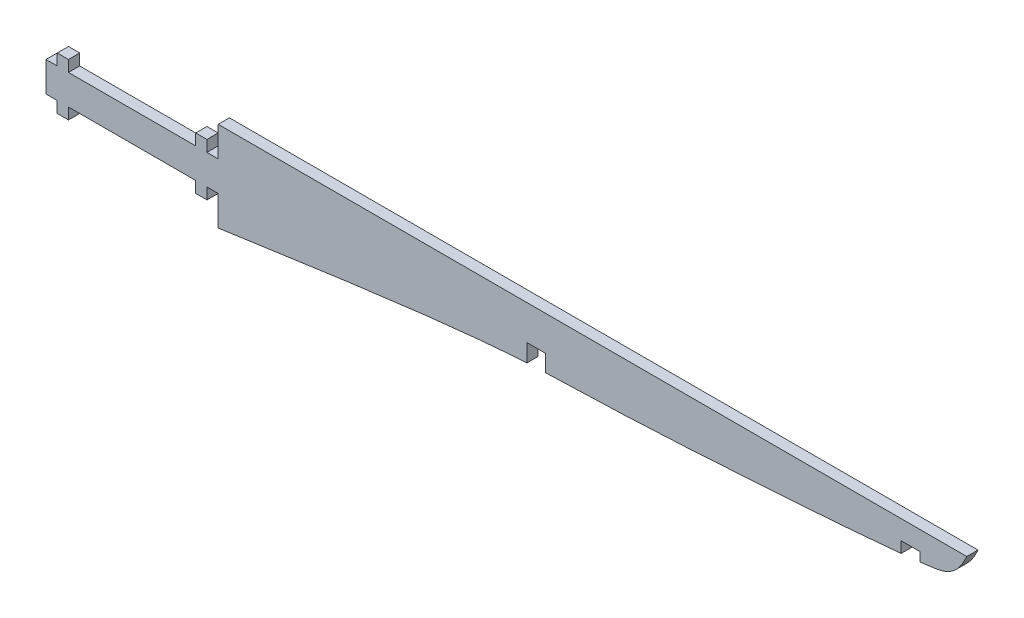
ISO-10303-21;
HEADER;
FILE_DESCRIPTION(('STEP AP214'),'2;1');
FILE_NAME('part.step','',(''),(''),'','','');
FILE_SCHEMA(('AUTOMOTIVE_DESIGN { 1 0 10303 214 1 1 1 1 }'));
ENDSEC;
DATA;
#1=APPLICATION_CONTEXT('core data for automotive mechanical design processes');
#2=APPLICATION_PROTOCOL_DEFINITION('international standard','automotive_design',2000,#1);
#3=PRODUCT_CONTEXT('',#1,'mechanical');
#4=PRODUCT('Part','Part','',(#3));
#5=PRODUCT_RELATED_PRODUCT_CATEGORY('part','',(#4));
#6=PRODUCT_DEFINITION_FORMATION('','',#4);
#7=PRODUCT_DEFINITION_CONTEXT('part definition',#1,'design');
#8=PRODUCT_DEFINITION('design','',#6,#7);
#9=PRODUCT_DEFINITION_SHAPE('','',#8);
#10=(LENGTH_UNIT() NAMED_UNIT(*) SI_UNIT(.MILLI.,.METRE.));
#11=(NAMED_UNIT(*) PLANE_ANGLE_UNIT() SI_UNIT($,.RADIAN.));
#12=(NAMED_UNIT(*) SI_UNIT($,.STERADIAN.) SOLID_ANGLE_UNIT());
#13=UNCERTAINTY_MEASURE_WITH_UNIT(LENGTH_MEASURE(1.E-05),#10,'distance_accuracy_value','');
#14=(GEOMETRIC_REPRESENTATION_CONTEXT(3) GLOBAL_UNCERTAINTY_ASSIGNED_CONTEXT((#13)) GLOBAL_UNIT_ASSIGNED_CONTEXT((#10,
#11,#12)) REPRESENTATION_CONTEXT('',''));
#15=CARTESIAN_POINT('',(0.,0.,0.));
#16=DIRECTION('',(0.,0.,1.));
#17=DIRECTION('',(1.,0.,0.));
#18=AXIS2_PLACEMENT_3D('',#15,#16,#17);
#19=CARTESIAN_POINT('',(22.9999999999992,-12.0000000000001,-201.434852992228));
#20=CARTESIAN_POINT('',(102.009324237539,-0.499389529340094,-201.434852992228));
#21=CARTESIAN_POINT('',(103.066716711816,-3.73892176111131,-201.434852992228));
#22=CARTESIAN_POINT('',(212.790204304645,3.93140842510151,-201.434852992228));
#23=CARTESIAN_POINT('',(218.702083633813,6.19593368992082,-201.434852992228));
#24=CARTESIAN_POINT('',(221.140597212589,7.89225513125744,-201.434852992228));
#25=CARTESIAN_POINT('',(223.,12.,-201.434852992228));
#26=B_SPLINE_CURVE_WITH_KNOTS('',3,(#19,#20,#21,#22,#23,#24,#25),.UNSPECIFIED.,.F.,.F.,(4,1,1,1,
4),(0.,0.416830050599476,0.767447509700155,0.830147222878966,1.),.UNSPECIFIED.);
#27=DIRECTION('',(0.,0.,1.));
#28=VECTOR('',#27,1.);
#29=SURFACE_OF_LINEAR_EXTRUSION('',#26,#28);
#30=DIRECTION('',(0.,0.,1.));
#31=VECTOR('',#30,1.);
#32=CARTESIAN_POINT('',(205.456458128454,3.92999307341578,1.49999999999997));
#33=LINE('',#32,#31);
#34=CARTESIAN_POINT('',(205.456458128454,3.92999307341615,3.));
#35=VERTEX_POINT('',#34);
#36=CARTESIAN_POINT('',(205.456458128454,3.92999307341578,0.));
#37=VERTEX_POINT('',#36);
#38=EDGE_CURVE('E43',#35,#37,#33,.F.);
#39=ORIENTED_EDGE('',*,*,#38,.F.);
#40=CARTESIAN_POINT('',(22.9999999999992,-12.0000000000001,3.));
#41=CARTESIAN_POINT('',(102.009324237539,-0.499389529340094,3.));
#42=CARTESIAN_POINT('',(103.066716711816,-3.73892176111131,3.));
#43=CARTESIAN_POINT('',(212.790204304645,3.93140842510151,3.));
#44=CARTESIAN_POINT('',(218.702083633813,6.19593368992082,3.));
#45=CARTESIAN_POINT('',(221.140597212589,7.89225513125744,3.));
#46=CARTESIAN_POINT('',(223.,12.,3.));
#47=B_SPLINE_CURVE_WITH_KNOTS('',3,(#40,#41,#42,#43,#44,#45,#46),.UNSPECIFIED.,.F.,.F.,(4,1,1,1,
4),(0.,0.416830050599476,0.767447509700155,0.830147222878966,1.),.UNSPECIFIED.);
#48=CARTESIAN_POINT('',(110.456458128454,-1.75701037397403,3.));
#49=VERTEX_POINT('',#48);
#50=EDGE_CURVE('E327',#49,#35,#47,.T.);
#51=ORIENTED_EDGE('',*,*,#50,.F.);
#52=DIRECTION('',(0.,0.,1.));
#53=VECTOR('',#52,1.);
#54=CARTESIAN_POINT('',(110.456458128453,-1.75701037397405,1.5));
#55=LINE('',#54,#53);
#56=CARTESIAN_POINT('',(110.456458128446,-1.75701037397435,0.));
#57=VERTEX_POINT('',#56);
#58=EDGE_CURVE('E476',#57,#49,#55,.T.);
#59=ORIENTED_EDGE('',*,*,#58,.F.);
#60=CARTESIAN_POINT('',(22.9999999999992,-12.0000000000001,0.));
#61=CARTESIAN_POINT('',(102.009324237539,-0.499389529340094,0.));
#62=CARTESIAN_POINT('',(103.066716711816,-3.73892176111131,0.));
#63=CARTESIAN_POINT('',(212.790204304645,3.93140842510151,0.));
#64=CARTESIAN_POINT('',(218.702083633813,6.19593368992082,0.));
#65=CARTESIAN_POINT('',(221.140597212589,7.89225513125744,0.));
#66=CARTESIAN_POINT('',(223.,12.,0.));
#67=B_SPLINE_CURVE_WITH_KNOTS('',3,(#60,#61,#62,#63,#64,#65,#66),.UNSPECIFIED.,.F.,.F.,(4,1,1,1,
4),(0.,0.416830050599476,0.767447509700155,0.830147222878966,1.),.UNSPECIFIED.);
#68=EDGE_CURVE('E58',#37,#57,#67,.F.);
#69=ORIENTED_EDGE('',*,*,#68,.F.);
#70=EDGE_LOOP('',(#39,#51,#59,#69));
#71=FACE_BOUND('',#70,.T.);
#72=ADVANCED_FACE('F35',(#71),#29,.T.);
#73=DIRECTION('',(0.,0.,1.));
#74=VECTOR('',#73,1.);
#75=CARTESIAN_POINT('',(105.456458128454,-2.00255164761175,1.5));
#76=LINE('',#75,#74);
#77=CARTESIAN_POINT('',(105.456458128454,-2.00255164761166,3.));
#78=VERTEX_POINT('',#77);
#79=CARTESIAN_POINT('',(105.456458128454,-2.00255164761175,0.));
#80=VERTEX_POINT('',#79);
#81=EDGE_CURVE('E478',#78,#80,#76,.F.);
#82=ORIENTED_EDGE('',*,*,#81,.F.);
#83=CARTESIAN_POINT('',(23.,-12.,3.));
#84=VERTEX_POINT('',#83);
#85=EDGE_CURVE('E325',#84,#78,#47,.T.);
#86=ORIENTED_EDGE('',*,*,#85,.F.);
#87=DIRECTION('',(0.,0.,1.));
#88=VECTOR('',#87,1.);
#89=CARTESIAN_POINT('',(23.,-12.,-201.434852992228));
#90=LINE('',#89,#88);
#91=CARTESIAN_POINT('',(23.,-12.,0.));
#92=VERTEX_POINT('',#91);
#93=EDGE_CURVE('E308',#92,#84,#90,.T.);
#94=ORIENTED_EDGE('',*,*,#93,.F.);
#95=EDGE_CURVE('E298',#80,#92,#67,.F.);
#96=ORIENTED_EDGE('',*,*,#95,.F.);
#97=EDGE_LOOP('',(#82,#86,#94,#96));
#98=FACE_BOUND('',#97,.T.);
#99=ADVANCED_FACE('F497',(#98),#29,.T.);
#100=CARTESIAN_POINT('',(-17.,0.,3.));
#101=DIRECTION('',(1.,0.,0.));
#102=DIRECTION('',(0.,1.,0.));
#103=AXIS2_PLACEMENT_3D('',#100,#101,#102);
#104=PLANE('',#103);
#105=DIRECTION('',(0.,-1.,0.));
#106=VECTOR('',#105,1.);
#107=CARTESIAN_POINT('',(-17.,0.,0.));
#108=LINE('',#107,#106);
#109=CARTESIAN_POINT('',(-17.,7.,0.));
#110=VERTEX_POINT('',#109);
#111=CARTESIAN_POINT('',(-17.,4.,0.));
#112=VERTEX_POINT('',#111);
#113=EDGE_CURVE('E301',#110,#112,#108,.T.);
#114=ORIENTED_EDGE('',*,*,#113,.F.);
#115=DIRECTION('',(0.,0.,-1.));
#116=VECTOR('',#115,1.);
#117=CARTESIAN_POINT('',(-17.,7.,3.));
#118=LINE('',#117,#116);
#119=CARTESIAN_POINT('',(-17.,7.,3.));
#120=VERTEX_POINT('',#119);
#121=EDGE_CURVE('E372',#120,#110,#118,.T.);
#122=ORIENTED_EDGE('',*,*,#121,.F.);
#123=DIRECTION('',(0.,-1.,0.));
#124=VECTOR('',#123,1.);
#125=CARTESIAN_POINT('',(-17.,0.,3.));
#126=LINE('',#125,#124);
#127=CARTESIAN_POINT('',(-17.,4.,3.));
#128=VERTEX_POINT('',#127);
#129=EDGE_CURVE('E449',#120,#128,#126,.T.);
#130=ORIENTED_EDGE('',*,*,#129,.T.);
#131=DIRECTION('',(0.,0.,-1.));
#132=VECTOR('',#131,1.);
#133=CARTESIAN_POINT('',(-17.,4.,3.));
#134=LINE('',#133,#132);
#135=EDGE_CURVE('E403',#128,#112,#134,.T.);
#136=ORIENTED_EDGE('',*,*,#135,.T.);
#137=EDGE_LOOP('',(#114,#122,#130,#136));
#138=FACE_BOUND('',#137,.T.);
#139=ADVANCED_FACE('F37',(#138),#104,.T.);
#140=CARTESIAN_POINT('',(0.,7.00000000000001,3.));
#141=DIRECTION('',(0.,-1.,0.));
#142=DIRECTION('',(1.,0.,0.));
#143=AXIS2_PLACEMENT_3D('',#140,#141,#142);
#144=PLANE('',#143);
#145=DIRECTION('',(-1.,0.,0.));
#146=VECTOR('',#145,1.);
#147=CARTESIAN_POINT('',(0.,7.00000000000001,0.));
#148=LINE('',#147,#146);
#149=CARTESIAN_POINT('',(-20.,7.,0.));
#150=VERTEX_POINT('',#149);
#151=EDGE_CURVE('E406',#110,#150,#148,.T.);
#152=ORIENTED_EDGE('',*,*,#151,.T.);
#153=DIRECTION('',(0.,0.,-1.));
#154=VECTOR('',#153,1.);
#155=CARTESIAN_POINT('',(-20.,7.,3.));
#156=LINE('',#155,#154);
#157=CARTESIAN_POINT('',(-20.,7.,3.));
#158=VERTEX_POINT('',#157);
#159=EDGE_CURVE('E855',#158,#150,#156,.T.);
#160=ORIENTED_EDGE('',*,*,#159,.F.);
#161=DIRECTION('',(-1.,0.,0.));
#162=VECTOR('',#161,1.);
#163=CARTESIAN_POINT('',(0.,7.00000000000001,3.));
#164=LINE('',#163,#162);
#165=EDGE_CURVE('E800',#120,#158,#164,.T.);
#166=ORIENTED_EDGE('',*,*,#165,.F.);
#167=ORIENTED_EDGE('',*,*,#121,.T.);
#168=EDGE_LOOP('',(#152,#160,#166,#167));
#169=FACE_BOUND('',#168,.T.);
#170=ADVANCED_FACE('F774',(#169),#144,.F.);
#171=CARTESIAN_POINT('',(-20.,0.,3.));
#172=DIRECTION('',(1.,0.,0.));
#173=DIRECTION('',(0.,1.,0.));
#174=AXIS2_PLACEMENT_3D('',#171,#172,#173);
#175=PLANE('',#174);
#176=DIRECTION('',(0.,-1.,0.));
#177=VECTOR('',#176,1.);
#178=CARTESIAN_POINT('',(-20.,0.,0.));
#179=LINE('',#178,#177);
#180=CARTESIAN_POINT('',(-20.,4.,0.));
#181=VERTEX_POINT('',#180);
#182=EDGE_CURVE('E408',#150,#181,#179,.T.);
#183=ORIENTED_EDGE('',*,*,#182,.T.);
#184=DIRECTION('',(0.,0.,-1.));
#185=VECTOR('',#184,1.);
#186=CARTESIAN_POINT('',(-20.,4.,3.));
#187=LINE('',#186,#185);
#188=CARTESIAN_POINT('',(-20.,4.,3.));
#189=VERTEX_POINT('',#188);
#190=EDGE_CURVE('E854',#189,#181,#187,.T.);
#191=ORIENTED_EDGE('',*,*,#190,.F.);
#192=DIRECTION('',(0.,-1.,0.));
#193=VECTOR('',#192,1.);
#194=CARTESIAN_POINT('',(-20.,0.,3.));
#195=LINE('',#194,#193);
#196=EDGE_CURVE('E802',#158,#189,#195,.T.);
#197=ORIENTED_EDGE('',*,*,#196,.F.);
#198=ORIENTED_EDGE('',*,*,#159,.T.);
#199=EDGE_LOOP('',(#183,#191,#197,#198));
#200=FACE_BOUND('',#199,.T.);
#201=ADVANCED_FACE('F764',(#200),#175,.F.);
#202=CARTESIAN_POINT('',(0.,4.,3.));
#203=DIRECTION('',(0.,1.,0.));
#204=DIRECTION('',(0.,0.,1.));
#205=AXIS2_PLACEMENT_3D('',#202,#203,#204);
#206=PLANE('',#205);
#207=DIRECTION('',(1.,0.,0.));
#208=VECTOR('',#207,1.);
#209=CARTESIAN_POINT('',(0.,4.,0.));
#210=LINE('',#209,#208);
#211=CARTESIAN_POINT('',(-23.,4.,0.));
#212=VERTEX_POINT('',#211);
#213=EDGE_CURVE('E411',#212,#181,#210,.T.);
#214=ORIENTED_EDGE('',*,*,#213,.F.);
#215=DIRECTION('',(0.,0.,-1.));
#216=VECTOR('',#215,1.);
#217=CARTESIAN_POINT('',(-23.,4.,3.));
#218=LINE('',#217,#216);
#219=CARTESIAN_POINT('',(-23.,4.,3.));
#220=VERTEX_POINT('',#219);
#221=EDGE_CURVE('E852',#220,#212,#218,.T.);
#222=ORIENTED_EDGE('',*,*,#221,.F.);
#223=DIRECTION('',(1.,0.,0.));
#224=VECTOR('',#223,1.);
#225=CARTESIAN_POINT('',(0.,4.,3.));
#226=LINE('',#225,#224);
#227=EDGE_CURVE('E806',#220,#189,#226,.T.);
#228=ORIENTED_EDGE('',*,*,#227,.T.);
#229=ORIENTED_EDGE('',*,*,#190,.T.);
#230=EDGE_LOOP('',(#214,#222,#228,#229));
#231=FACE_BOUND('',#230,.T.);
#232=ADVANCED_FACE('F754',(#231),#206,.T.);
#233=CARTESIAN_POINT('',(-23.,0.,3.));
#234=DIRECTION('',(-1.,0.,0.));
#235=DIRECTION('',(0.,0.,1.));
#236=AXIS2_PLACEMENT_3D('',#233,#234,#235);
#237=PLANE('',#236);
#238=DIRECTION('',(0.,1.,0.));
#239=VECTOR('',#238,1.);
#240=CARTESIAN_POINT('',(-23.,0.,0.));
#241=LINE('',#240,#239);
#242=CARTESIAN_POINT('',(-23.,-4.,0.));
#243=VERTEX_POINT('',#242);
#244=EDGE_CURVE('E414',#243,#212,#241,.T.);
#245=ORIENTED_EDGE('',*,*,#244,.F.);
#246=DIRECTION('',(0.,0.,-1.));
#247=VECTOR('',#246,1.);
#248=CARTESIAN_POINT('',(-23.,-4.,3.));
#249=LINE('',#248,#247);
#250=CARTESIAN_POINT('',(-23.,-4.,3.));
#251=VERTEX_POINT('',#250);
#252=EDGE_CURVE('E850',#251,#243,#249,.T.);
#253=ORIENTED_EDGE('',*,*,#252,.F.);
#254=DIRECTION('',(0.,1.,0.));
#255=VECTOR('',#254,1.);
#256=CARTESIAN_POINT('',(-23.,0.,3.));
#257=LINE('',#256,#255);
#258=EDGE_CURVE('E809',#251,#220,#257,.T.);
#259=ORIENTED_EDGE('',*,*,#258,.T.);
#260=ORIENTED_EDGE('',*,*,#221,.T.);
#261=EDGE_LOOP('',(#245,#253,#259,#260));
#262=FACE_BOUND('',#261,.T.);
#263=ADVANCED_FACE('F744',(#262),#237,.T.);
#264=CARTESIAN_POINT('',(0.,-4.,3.));
#265=DIRECTION('',(0.,1.,0.));
#266=DIRECTION('',(0.,0.,1.));
#267=AXIS2_PLACEMENT_3D('',#264,#265,#266);
#268=PLANE('',#267);
#269=DIRECTION('',(1.,0.,0.));
#270=VECTOR('',#269,1.);
#271=CARTESIAN_POINT('',(0.,-4.,0.));
#272=LINE('',#271,#270);
#273=CARTESIAN_POINT('',(-20.,-4.,0.));
#274=VERTEX_POINT('',#273);
#275=EDGE_CURVE('E417',#243,#274,#272,.T.);
#276=ORIENTED_EDGE('',*,*,#275,.T.);
#277=DIRECTION('',(0.,0.,-1.));
#278=VECTOR('',#277,1.);
#279=CARTESIAN_POINT('',(-20.,-4.,3.));
#280=LINE('',#279,#278);
#281=CARTESIAN_POINT('',(-20.,-4.,3.));
#282=VERTEX_POINT('',#281);
#283=EDGE_CURVE('E847',#282,#274,#280,.T.);
#284=ORIENTED_EDGE('',*,*,#283,.F.);
#285=DIRECTION('',(1.,0.,0.));
#286=VECTOR('',#285,1.);
#287=CARTESIAN_POINT('',(0.,-4.,3.));
#288=LINE('',#287,#286);
#289=EDGE_CURVE('E812',#251,#282,#288,.T.);
#290=ORIENTED_EDGE('',*,*,#289,.F.);
#291=ORIENTED_EDGE('',*,*,#252,.T.);
#292=EDGE_LOOP('',(#276,#284,#290,#291));
#293=FACE_BOUND('',#292,.T.);
#294=ADVANCED_FACE('F734',(#293),#268,.F.);
#295=CARTESIAN_POINT('',(-20.,0.,3.));
#296=DIRECTION('',(1.,0.,0.));
#297=DIRECTION('',(0.,1.,0.));
#298=AXIS2_PLACEMENT_3D('',#295,#296,#297);
#299=PLANE('',#298);
#300=DIRECTION('',(0.,-1.,0.));
#301=VECTOR('',#300,1.);
#302=CARTESIAN_POINT('',(-20.,0.,0.));
#303=LINE('',#302,#301);
#304=CARTESIAN_POINT('',(-20.,-6.99999999999999,0.));
#305=VERTEX_POINT('',#304);
#306=EDGE_CURVE('E419',#274,#305,#303,.T.);
#307=ORIENTED_EDGE('',*,*,#306,.T.);
#308=DIRECTION('',(0.,0.,-1.));
#309=VECTOR('',#308,1.);
#310=CARTESIAN_POINT('',(-20.,-6.99999999999999,3.));
#311=LINE('',#310,#309);
#312=CARTESIAN_POINT('',(-20.,-6.99999999999999,3.));
#313=VERTEX_POINT('',#312);
#314=EDGE_CURVE('E845',#313,#305,#311,.T.);
#315=ORIENTED_EDGE('',*,*,#314,.F.);
#316=DIRECTION('',(0.,-1.,0.));
#317=VECTOR('',#316,1.);
#318=CARTESIAN_POINT('',(-20.,0.,3.));
#319=LINE('',#318,#317);
#320=EDGE_CURVE('E814',#282,#313,#319,.T.);
#321=ORIENTED_EDGE('',*,*,#320,.F.);
#322=ORIENTED_EDGE('',*,*,#283,.T.);
#323=EDGE_LOOP('',(#307,#315,#321,#322));
#324=FACE_BOUND('',#323,.T.);
#325=ADVANCED_FACE('F724',(#324),#299,.F.);
#326=CARTESIAN_POINT('',(0.,-7.00000000000001,3.));
#327=DIRECTION('',(0.,-1.,0.));
#328=DIRECTION('',(1.,0.,0.));
#329=AXIS2_PLACEMENT_3D('',#326,#327,#328);
#330=PLANE('',#329);
#331=DIRECTION('',(-1.,0.,0.));
#332=VECTOR('',#331,1.);
#333=CARTESIAN_POINT('',(0.,-7.00000000000001,0.));
#334=LINE('',#333,#332);
#335=CARTESIAN_POINT('',(-17.,-6.99999999999999,0.));
#336=VERTEX_POINT('',#335);
#337=EDGE_CURVE('E422',#336,#305,#334,.T.);
#338=ORIENTED_EDGE('',*,*,#337,.F.);
#339=DIRECTION('',(0.,0.,-1.));
#340=VECTOR('',#339,1.);
#341=CARTESIAN_POINT('',(-17.,-6.99999999999999,3.));
#342=LINE('',#341,#340);
#343=CARTESIAN_POINT('',(-17.,-6.99999999999999,3.));
#344=VERTEX_POINT('',#343);
#345=EDGE_CURVE('E843',#344,#336,#342,.T.);
#346=ORIENTED_EDGE('',*,*,#345,.F.);
#347=DIRECTION('',(-1.,0.,0.));
#348=VECTOR('',#347,1.);
#349=CARTESIAN_POINT('',(0.,-7.00000000000001,3.));
#350=LINE('',#349,#348);
#351=EDGE_CURVE('E816',#344,#313,#350,.T.);
#352=ORIENTED_EDGE('',*,*,#351,.T.);
#353=ORIENTED_EDGE('',*,*,#314,.T.);
#354=EDGE_LOOP('',(#338,#346,#352,#353));
#355=FACE_BOUND('',#354,.T.);
#356=ADVANCED_FACE('F714',(#355),#330,.T.);
#357=CARTESIAN_POINT('',(-17.,0.,3.));
#358=DIRECTION('',(1.,0.,0.));
#359=DIRECTION('',(0.,1.,0.));
#360=AXIS2_PLACEMENT_3D('',#357,#358,#359);
#361=PLANE('',#360);
#362=DIRECTION('',(0.,-1.,0.));
#363=VECTOR('',#362,1.);
#364=CARTESIAN_POINT('',(-17.,0.,0.));
#365=LINE('',#364,#363);
#366=CARTESIAN_POINT('',(-17.,-4.,0.));
#367=VERTEX_POINT('',#366);
#368=EDGE_CURVE('E425',#367,#336,#365,.T.);
#369=ORIENTED_EDGE('',*,*,#368,.F.);
#370=DIRECTION('',(0.,0.,-1.));
#371=VECTOR('',#370,1.);
#372=CARTESIAN_POINT('',(-17.,-4.,3.));
#373=LINE('',#372,#371);
#374=CARTESIAN_POINT('',(-17.,-4.,3.));
#375=VERTEX_POINT('',#374);
#376=EDGE_CURVE('E841',#375,#367,#373,.T.);
#377=ORIENTED_EDGE('',*,*,#376,.F.);
#378=DIRECTION('',(0.,-1.,0.));
#379=VECTOR('',#378,1.);
#380=CARTESIAN_POINT('',(-17.,0.,3.));
#381=LINE('',#380,#379);
#382=EDGE_CURVE('E819',#375,#344,#381,.T.);
#383=ORIENTED_EDGE('',*,*,#382,.T.);
#384=ORIENTED_EDGE('',*,*,#345,.T.);
#385=EDGE_LOOP('',(#369,#377,#383,#384));
#386=FACE_BOUND('',#385,.T.);
#387=ADVANCED_FACE('F704',(#386),#361,.T.);
#388=CARTESIAN_POINT('',(0.,-4.,3.));
#389=DIRECTION('',(0.,1.,0.));
#390=DIRECTION('',(0.,0.,1.));
#391=AXIS2_PLACEMENT_3D('',#388,#389,#390);
#392=PLANE('',#391);
#393=DIRECTION('',(1.,0.,0.));
#394=VECTOR('',#393,1.);
#395=CARTESIAN_POINT('',(0.,-4.,0.));
#396=LINE('',#395,#394);
#397=CARTESIAN_POINT('',(17.,-4.,0.));
#398=VERTEX_POINT('',#397);
#399=EDGE_CURVE('E428',#367,#398,#396,.T.);
#400=ORIENTED_EDGE('',*,*,#399,.T.);
#401=DIRECTION('',(0.,0.,-1.));
#402=VECTOR('',#401,1.);
#403=CARTESIAN_POINT('',(17.,-4.,3.));
#404=LINE('',#403,#402);
#405=CARTESIAN_POINT('',(17.,-4.,3.));
#406=VERTEX_POINT('',#405);
#407=EDGE_CURVE('E835',#406,#398,#404,.T.);
#408=ORIENTED_EDGE('',*,*,#407,.F.);
#409=DIRECTION('',(1.,0.,0.));
#410=VECTOR('',#409,1.);
#411=CARTESIAN_POINT('',(0.,-4.,3.));
#412=LINE('',#411,#410);
#413=EDGE_CURVE('E822',#375,#406,#412,.T.);
#414=ORIENTED_EDGE('',*,*,#413,.F.);
#415=ORIENTED_EDGE('',*,*,#376,.T.);
#416=EDGE_LOOP('',(#400,#408,#414,#415));
#417=FACE_BOUND('',#416,.T.);
#418=ADVANCED_FACE('F694',(#417),#392,.F.);
#419=CARTESIAN_POINT('',(17.,0.,3.));
#420=DIRECTION('',(1.,0.,0.));
#421=DIRECTION('',(0.,1.,0.));
#422=AXIS2_PLACEMENT_3D('',#419,#420,#421);
#423=PLANE('',#422);
#424=DIRECTION('',(0.,-1.,0.));
#425=VECTOR('',#424,1.);
#426=CARTESIAN_POINT('',(17.,0.,0.));
#427=LINE('',#426,#425);
#428=CARTESIAN_POINT('',(17.,-6.99999999999999,0.));
#429=VERTEX_POINT('',#428);
#430=EDGE_CURVE('E430',#398,#429,#427,.T.);
#431=ORIENTED_EDGE('',*,*,#430,.T.);
#432=DIRECTION('',(0.,0.,-1.));
#433=VECTOR('',#432,1.);
#434=CARTESIAN_POINT('',(17.,-6.99999999999999,3.));
#435=LINE('',#434,#433);
#436=CARTESIAN_POINT('',(17.,-6.99999999999999,3.));
#437=VERTEX_POINT('',#436);
#438=EDGE_CURVE('E832',#437,#429,#435,.T.);
#439=ORIENTED_EDGE('',*,*,#438,.F.);
#440=DIRECTION('',(0.,-1.,0.));
#441=VECTOR('',#440,1.);
#442=CARTESIAN_POINT('',(17.,0.,3.));
#443=LINE('',#442,#441);
#444=EDGE_CURVE('E389',#406,#437,#443,.T.);
#445=ORIENTED_EDGE('',*,*,#444,.F.);
#446=ORIENTED_EDGE('',*,*,#407,.T.);
#447=EDGE_LOOP('',(#431,#439,#445,#446));
#448=FACE_BOUND('',#447,.T.);
#449=ADVANCED_FACE('F684',(#448),#423,.F.);
#450=CARTESIAN_POINT('',(0.,-7.00000000000001,3.));
#451=DIRECTION('',(0.,1.,0.));
#452=DIRECTION('',(-1.,0.,0.));
#453=AXIS2_PLACEMENT_3D('',#450,#451,#452);
#454=PLANE('',#453);
#455=DIRECTION('',(1.,0.,0.));
#456=VECTOR('',#455,1.);
#457=CARTESIAN_POINT('',(0.,-7.00000000000001,0.));
#458=LINE('',#457,#456);
#459=CARTESIAN_POINT('',(20.,-6.99999999999999,0.));
#460=VERTEX_POINT('',#459);
#461=EDGE_CURVE('E432',#429,#460,#458,.T.);
#462=ORIENTED_EDGE('',*,*,#461,.T.);
#463=DIRECTION('',(0.,0.,-1.));
#464=VECTOR('',#463,1.);
#465=CARTESIAN_POINT('',(20.,-6.99999999999999,3.));
#466=LINE('',#465,#464);
#467=CARTESIAN_POINT('',(20.,-6.99999999999999,3.));
#468=VERTEX_POINT('',#467);
#469=EDGE_CURVE('E836',#468,#460,#466,.T.);
#470=ORIENTED_EDGE('',*,*,#469,.F.);
#471=DIRECTION('',(1.,0.,0.));
#472=VECTOR('',#471,1.);
#473=CARTESIAN_POINT('',(0.,-7.00000000000001,3.));
#474=LINE('',#473,#472);
#475=EDGE_CURVE('E386',#437,#468,#474,.T.);
#476=ORIENTED_EDGE('',*,*,#475,.F.);
#477=ORIENTED_EDGE('',*,*,#438,.T.);
#478=EDGE_LOOP('',(#462,#470,#476,#477));
#479=FACE_BOUND('',#478,.T.);
#480=ADVANCED_FACE('F675',(#479),#454,.F.);
#481=CARTESIAN_POINT('',(20.,0.,3.));
#482=DIRECTION('',(1.,0.,0.));
#483=DIRECTION('',(0.,1.,0.));
#484=AXIS2_PLACEMENT_3D('',#481,#482,#483);
#485=PLANE('',#484);
#486=DIRECTION('',(0.,-1.,0.));
#487=VECTOR('',#486,1.);
#488=CARTESIAN_POINT('',(20.,0.,0.));
#489=LINE('',#488,#487);
#490=CARTESIAN_POINT('',(20.,-4.,0.));
#491=VERTEX_POINT('',#490);
#492=EDGE_CURVE('E377',#491,#460,#489,.T.);
#493=ORIENTED_EDGE('',*,*,#492,.F.);
#494=DIRECTION('',(0.,0.,-1.));
#495=VECTOR('',#494,1.);
#496=CARTESIAN_POINT('',(20.,-4.,3.));
#497=LINE('',#496,#495);
#498=CARTESIAN_POINT('',(20.,-4.,3.));
#499=VERTEX_POINT('',#498);
#500=EDGE_CURVE('E353',#499,#491,#497,.T.);
#501=ORIENTED_EDGE('',*,*,#500,.F.);
#502=DIRECTION('',(0.,-1.,0.));
#503=VECTOR('',#502,1.);
#504=CARTESIAN_POINT('',(20.,0.,3.));
#505=LINE('',#504,#503);
#506=EDGE_CURVE('E380',#499,#468,#505,.T.);
#507=ORIENTED_EDGE('',*,*,#506,.T.);
#508=ORIENTED_EDGE('',*,*,#469,.T.);
#509=EDGE_LOOP('',(#493,#501,#507,#508));
#510=FACE_BOUND('',#509,.T.);
#511=ADVANCED_FACE('F634',(#510),#485,.T.);
#512=CARTESIAN_POINT('',(0.,-4.,3.));
#513=DIRECTION('',(0.,1.,0.));
#514=DIRECTION('',(0.,0.,1.));
#515=AXIS2_PLACEMENT_3D('',#512,#513,#514);
#516=PLANE('',#515);
#517=DIRECTION('',(1.,0.,0.));
#518=VECTOR('',#517,1.);
#519=CARTESIAN_POINT('',(0.,-4.,0.));
#520=LINE('',#519,#518);
#521=CARTESIAN_POINT('',(23.,-4.,0.));
#522=VERTEX_POINT('',#521);
#523=EDGE_CURVE('E374',#491,#522,#520,.T.);
#524=ORIENTED_EDGE('',*,*,#523,.T.);
#525=DIRECTION('',(0.,0.,-1.));
#526=VECTOR('',#525,1.);
#527=CARTESIAN_POINT('',(23.,-4.,3.));
#528=LINE('',#527,#526);
#529=CARTESIAN_POINT('',(23.,-4.,3.));
#530=VERTEX_POINT('',#529);
#531=EDGE_CURVE('E349',#530,#522,#528,.T.);
#532=ORIENTED_EDGE('',*,*,#531,.F.);
#533=DIRECTION('',(1.,0.,0.));
#534=VECTOR('',#533,1.);
#535=CARTESIAN_POINT('',(0.,-4.,3.));
#536=LINE('',#535,#534);
#537=EDGE_CURVE('E379',#499,#530,#536,.T.);
#538=ORIENTED_EDGE('',*,*,#537,.F.);
#539=ORIENTED_EDGE('',*,*,#500,.T.);
#540=EDGE_LOOP('',(#524,#532,#538,#539));
#541=FACE_BOUND('',#540,.T.);
#542=ADVANCED_FACE('F623',(#541),#516,.F.);
#543=CARTESIAN_POINT('',(0.,4.,3.));
#544=DIRECTION('',(0.,1.,0.));
#545=DIRECTION('',(0.,0.,1.));
#546=AXIS2_PLACEMENT_3D('',#543,#544,#545);
#547=PLANE('',#546);
#548=DIRECTION('',(1.,0.,0.));
#549=VECTOR('',#548,1.);
#550=CARTESIAN_POINT('',(0.,4.,0.));
#551=LINE('',#550,#549);
#552=CARTESIAN_POINT('',(20.,4.,0.));
#553=VERTEX_POINT('',#552);
#554=CARTESIAN_POINT('',(23.,4.,0.));
#555=VERTEX_POINT('',#554);
#556=EDGE_CURVE('E376',#553,#555,#551,.T.);
#557=ORIENTED_EDGE('',*,*,#556,.F.);
#558=DIRECTION('',(0.,0.,-1.));
#559=VECTOR('',#558,1.);
#560=CARTESIAN_POINT('',(20.,4.,3.));
#561=LINE('',#560,#559);
#562=CARTESIAN_POINT('',(20.,4.,3.));
#563=VERTEX_POINT('',#562);
#564=EDGE_CURVE('E350',#563,#553,#561,.T.);
#565=ORIENTED_EDGE('',*,*,#564,.F.);
#566=DIRECTION('',(1.,0.,0.));
#567=VECTOR('',#566,1.);
#568=CARTESIAN_POINT('',(0.,4.,3.));
#569=LINE('',#568,#567);
#570=CARTESIAN_POINT('',(23.,4.,3.));
#571=VERTEX_POINT('',#570);
#572=EDGE_CURVE('E362',#563,#571,#569,.T.);
#573=ORIENTED_EDGE('',*,*,#572,.T.);
#574=DIRECTION('',(0.,0.,-1.));
#575=VECTOR('',#574,1.);
#576=CARTESIAN_POINT('',(23.,4.,3.));
#577=LINE('',#576,#575);
#578=EDGE_CURVE('E345',#571,#555,#577,.T.);
#579=ORIENTED_EDGE('',*,*,#578,.T.);
#580=EDGE_LOOP('',(#557,#565,#573,#579));
#581=FACE_BOUND('',#580,.T.);
#582=ADVANCED_FACE('F470',(#581),#547,.T.);
#583=CARTESIAN_POINT('',(20.,0.,3.));
#584=DIRECTION('',(1.,0.,0.));
#585=DIRECTION('',(0.,1.,0.));
#586=AXIS2_PLACEMENT_3D('',#583,#584,#585);
#587=PLANE('',#586);
#588=DIRECTION('',(0.,-1.,0.));
#589=VECTOR('',#588,1.);
#590=CARTESIAN_POINT('',(20.,0.,0.));
#591=LINE('',#590,#589);
#592=CARTESIAN_POINT('',(20.,7.,0.));
#593=VERTEX_POINT('',#592);
#594=EDGE_CURVE('E437',#593,#553,#591,.T.);
#595=ORIENTED_EDGE('',*,*,#594,.F.);
#596=DIRECTION('',(0.,0.,-1.));
#597=VECTOR('',#596,1.);
#598=CARTESIAN_POINT('',(20.,7.,3.));
#599=LINE('',#598,#597);
#600=CARTESIAN_POINT('',(20.,7.,3.));
#601=VERTEX_POINT('',#600);
#602=EDGE_CURVE('E355',#601,#593,#599,.T.);
#603=ORIENTED_EDGE('',*,*,#602,.F.);
#604=DIRECTION('',(0.,-1.,0.));
#605=VECTOR('',#604,1.);
#606=CARTESIAN_POINT('',(20.,0.,3.));
#607=LINE('',#606,#605);
#608=EDGE_CURVE('E384',#601,#563,#607,.T.);
#609=ORIENTED_EDGE('',*,*,#608,.T.);
#610=ORIENTED_EDGE('',*,*,#564,.T.);
#611=EDGE_LOOP('',(#595,#603,#609,#610));
#612=FACE_BOUND('',#611,.T.);
#613=ADVANCED_FACE('F461',(#612),#587,.T.);
#614=CARTESIAN_POINT('',(0.,7.00000000000001,3.));
#615=DIRECTION('',(0.,1.,0.));
#616=DIRECTION('',(-1.,0.,0.));
#617=AXIS2_PLACEMENT_3D('',#614,#615,#616);
#618=PLANE('',#617);
#619=DIRECTION('',(1.,0.,0.));
#620=VECTOR('',#619,1.);
#621=CARTESIAN_POINT('',(0.,7.00000000000001,0.));
#622=LINE('',#621,#620);
#623=CARTESIAN_POINT('',(17.,7.,0.));
#624=VERTEX_POINT('',#623);
#625=EDGE_CURVE('E440',#624,#593,#622,.T.);
#626=ORIENTED_EDGE('',*,*,#625,.F.);
#627=DIRECTION('',(0.,0.,-1.));
#628=VECTOR('',#627,1.);
#629=CARTESIAN_POINT('',(17.,7.,3.));
#630=LINE('',#629,#628);
#631=CARTESIAN_POINT('',(17.,7.,3.));
#632=VERTEX_POINT('',#631);
#633=EDGE_CURVE('E453',#632,#624,#630,.T.);
#634=ORIENTED_EDGE('',*,*,#633,.F.);
#635=DIRECTION('',(1.,0.,0.));
#636=VECTOR('',#635,1.);
#637=CARTESIAN_POINT('',(0.,7.00000000000001,3.));
#638=LINE('',#637,#636);
#639=EDGE_CURVE('E395',#632,#601,#638,.T.);
#640=ORIENTED_EDGE('',*,*,#639,.T.);
#641=ORIENTED_EDGE('',*,*,#602,.T.);
#642=EDGE_LOOP('',(#626,#634,#640,#641));
#643=FACE_BOUND('',#642,.T.);
#644=ADVANCED_FACE('F457',(#643),#618,.T.);
#645=CARTESIAN_POINT('',(17.,0.,3.));
#646=DIRECTION('',(1.,0.,0.));
#647=DIRECTION('',(0.,1.,0.));
#648=AXIS2_PLACEMENT_3D('',#645,#646,#647);
#649=PLANE('',#648);
#650=DIRECTION('',(0.,-1.,0.));
#651=VECTOR('',#650,1.);
#652=CARTESIAN_POINT('',(17.,0.,0.));
#653=LINE('',#652,#651);
#654=CARTESIAN_POINT('',(17.,4.,0.));
#655=VERTEX_POINT('',#654);
#656=EDGE_CURVE('E443',#624,#655,#653,.T.);
#657=ORIENTED_EDGE('',*,*,#656,.T.);
#658=DIRECTION('',(0.,0.,-1.));
#659=VECTOR('',#658,1.);
#660=CARTESIAN_POINT('',(17.,4.,3.));
#661=LINE('',#660,#659);
#662=CARTESIAN_POINT('',(17.,4.,3.));
#663=VERTEX_POINT('',#662);
#664=EDGE_CURVE('E451',#663,#655,#661,.T.);
#665=ORIENTED_EDGE('',*,*,#664,.F.);
#666=DIRECTION('',(0.,-1.,0.));
#667=VECTOR('',#666,1.);
#668=CARTESIAN_POINT('',(17.,0.,3.));
#669=LINE('',#668,#667);
#670=EDGE_CURVE('E398',#632,#663,#669,.T.);
#671=ORIENTED_EDGE('',*,*,#670,.F.);
#672=ORIENTED_EDGE('',*,*,#633,.T.);
#673=EDGE_LOOP('',(#657,#665,#671,#672));
#674=FACE_BOUND('',#673,.T.);
#675=ADVANCED_FACE('F467',(#674),#649,.F.);
#676=CARTESIAN_POINT('',(0.,4.,3.));
#677=DIRECTION('',(0.,1.,0.));
#678=DIRECTION('',(0.,0.,1.));
#679=AXIS2_PLACEMENT_3D('',#676,#677,#678);
#680=PLANE('',#679);
#681=DIRECTION('',(1.,0.,0.));
#682=VECTOR('',#681,1.);
#683=CARTESIAN_POINT('',(0.,4.,0.));
#684=LINE('',#683,#682);
#685=EDGE_CURVE('E446',#112,#655,#684,.T.);
#686=ORIENTED_EDGE('',*,*,#685,.F.);
#687=ORIENTED_EDGE('',*,*,#135,.F.);
#688=DIRECTION('',(1.,0.,0.));
#689=VECTOR('',#688,1.);
#690=CARTESIAN_POINT('',(0.,4.,3.));
#691=LINE('',#690,#689);
#692=EDGE_CURVE('E400',#128,#663,#691,.T.);
#693=ORIENTED_EDGE('',*,*,#692,.T.);
#694=ORIENTED_EDGE('',*,*,#664,.T.);
#695=EDGE_LOOP('',(#686,#687,#693,#694));
#696=FACE_BOUND('',#695,.T.);
#697=ADVANCED_FACE('F591',(#696),#680,.T.);
#698=CARTESIAN_POINT('',(0.,0.,3.));
#699=DIRECTION('',(0.,0.,1.));
#700=DIRECTION('',(1.,0.,0.));
#701=AXIS2_PLACEMENT_3D('',#698,#699,#700);
#702=PLANE('',#701);
#703=DIRECTION('',(0.,-1.,0.));
#704=VECTOR('',#703,1.);
#705=CARTESIAN_POINT('',(205.456458128454,-8.76114529898331,3.));
#706=LINE('',#705,#704);
#707=CARTESIAN_POINT('',(205.456458128454,6.8775295814838,3.));
#708=VERTEX_POINT('',#707);
#709=EDGE_CURVE('E255',#708,#35,#706,.T.);
#710=ORIENTED_EDGE('',*,*,#709,.F.);
#711=DIRECTION('',(-1.,0.,0.));
#712=VECTOR('',#711,1.);
#713=CARTESIAN_POINT('',(205.456458128454,6.8775295814838,3.));
#714=LINE('',#713,#712);
#715=CARTESIAN_POINT('',(210.456458128454,6.8775295814838,3.));
#716=VERTEX_POINT('',#715);
#717=EDGE_CURVE('E245',#716,#708,#714,.T.);
#718=ORIENTED_EDGE('',*,*,#717,.F.);
#719=DIRECTION('',(0.,1.,0.));
#720=VECTOR('',#719,1.);
#721=CARTESIAN_POINT('',(210.456458128454,-8.76114529898331,3.));
#722=LINE('',#721,#720);
#723=CARTESIAN_POINT('',(210.456458128454,4.45516085627823,3.));
#724=VERTEX_POINT('',#723);
#725=EDGE_CURVE('E250',#724,#716,#722,.T.);
#726=ORIENTED_EDGE('',*,*,#725,.F.);
#727=CARTESIAN_POINT('',(223.,12.,3.));
#728=VERTEX_POINT('',#727);
#729=EDGE_CURVE('E283',#724,#728,#47,.T.);
#730=ORIENTED_EDGE('',*,*,#729,.T.);
#731=DIRECTION('',(-1.,0.,0.));
#732=VECTOR('',#731,1.);
#733=CARTESIAN_POINT('',(23.,12.,3.));
#734=LINE('',#733,#732);
#735=CARTESIAN_POINT('',(23.,12.,3.));
#736=VERTEX_POINT('',#735);
#737=EDGE_CURVE('E313',#728,#736,#734,.T.);
#738=ORIENTED_EDGE('',*,*,#737,.T.);
#739=DIRECTION('',(0.,-1.,0.));
#740=VECTOR('',#739,1.);
#741=CARTESIAN_POINT('',(23.,-12.,3.));
#742=LINE('',#741,#740);
#743=EDGE_CURVE('E306',#736,#571,#742,.T.);
#744=ORIENTED_EDGE('',*,*,#743,.T.);
#745=ORIENTED_EDGE('',*,*,#572,.F.);
#746=ORIENTED_EDGE('',*,*,#608,.F.);
#747=ORIENTED_EDGE('',*,*,#639,.F.);
#748=ORIENTED_EDGE('',*,*,#670,.T.);
#749=ORIENTED_EDGE('',*,*,#692,.F.);
#750=ORIENTED_EDGE('',*,*,#129,.F.);
#751=ORIENTED_EDGE('',*,*,#165,.T.);
#752=ORIENTED_EDGE('',*,*,#196,.T.);
#753=ORIENTED_EDGE('',*,*,#227,.F.);
#754=ORIENTED_EDGE('',*,*,#258,.F.);
#755=ORIENTED_EDGE('',*,*,#289,.T.);
#756=ORIENTED_EDGE('',*,*,#320,.T.);
#757=ORIENTED_EDGE('',*,*,#351,.F.);
#758=ORIENTED_EDGE('',*,*,#382,.F.);
#759=ORIENTED_EDGE('',*,*,#413,.T.);
#760=ORIENTED_EDGE('',*,*,#444,.T.);
#761=ORIENTED_EDGE('',*,*,#475,.T.);
#762=ORIENTED_EDGE('',*,*,#506,.F.);
#763=ORIENTED_EDGE('',*,*,#537,.T.);
#764=EDGE_CURVE('E317',#530,#84,#742,.T.);
#765=ORIENTED_EDGE('',*,*,#764,.T.);
#766=ORIENTED_EDGE('',*,*,#85,.T.);
#767=DIRECTION('',(0.,-1.,0.));
#768=VECTOR('',#767,1.);
#769=CARTESIAN_POINT('',(105.456458128454,-8.76114529898331,3.));
#770=LINE('',#769,#768);
#771=CARTESIAN_POINT('',(105.456458128454,2.74388143553495,3.));
#772=VERTEX_POINT('',#771);
#773=EDGE_CURVE('E266',#772,#78,#770,.T.);
#774=ORIENTED_EDGE('',*,*,#773,.F.);
#775=DIRECTION('',(-1.,0.,0.));
#776=VECTOR('',#775,1.);
#777=CARTESIAN_POINT('',(105.456458128454,2.74388143553495,3.));
#778=LINE('',#777,#776);
#779=CARTESIAN_POINT('',(110.456458128454,2.74388143553495,3.));
#780=VERTEX_POINT('',#779);
#781=EDGE_CURVE('E271',#780,#772,#778,.T.);
#782=ORIENTED_EDGE('',*,*,#781,.F.);
#783=DIRECTION('',(0.,1.,0.));
#784=VECTOR('',#783,1.);
#785=CARTESIAN_POINT('',(110.456458128454,-8.76114529898331,3.));
#786=LINE('',#785,#784);
#787=EDGE_CURVE('E268',#49,#780,#786,.T.);
#788=ORIENTED_EDGE('',*,*,#787,.F.);
#789=ORIENTED_EDGE('',*,*,#50,.T.);
#790=EDGE_LOOP('',(#710,#718,#726,#730,#738,#744,#745,#746,#747,#748,#749,#750,#751,#752,#753,
#754,#755,#756,#757,#758,#759,#760,#761,#762,#763,#765,#766,#774,#782,#788,#789));
#791=FACE_BOUND('',#790,.T.);
#792=ADVANCED_FACE('F257',(#791),#702,.T.);
#793=CARTESIAN_POINT('',(0.,0.,0.));
#794=DIRECTION('',(0.,0.,1.));
#795=DIRECTION('',(1.,0.,0.));
#796=AXIS2_PLACEMENT_3D('',#793,#794,#795);
#797=PLANE('',#796);
#798=DIRECTION('',(-1.,0.,0.));
#799=VECTOR('',#798,1.);
#800=CARTESIAN_POINT('',(0.,6.8775295814838,0.));
#801=LINE('',#800,#799);
#802=CARTESIAN_POINT('',(210.456458128454,6.8775295814838,0.));
#803=VERTEX_POINT('',#802);
#804=CARTESIAN_POINT('',(205.456458128454,6.8775295814838,0.));
#805=VERTEX_POINT('',#804);
#806=EDGE_CURVE('E11',#803,#805,#801,.T.);
#807=ORIENTED_EDGE('',*,*,#806,.T.);
#808=DIRECTION('',(0.,-1.,0.));
#809=VECTOR('',#808,1.);
#810=CARTESIAN_POINT('',(205.456458128454,0.,0.));
#811=LINE('',#810,#809);
#812=EDGE_CURVE('E264',#805,#37,#811,.T.);
#813=ORIENTED_EDGE('',*,*,#812,.T.);
#814=ORIENTED_EDGE('',*,*,#68,.T.);
#815=DIRECTION('',(0.,1.,0.));
#816=VECTOR('',#815,1.);
#817=CARTESIAN_POINT('',(110.456458128454,0.,0.));
#818=LINE('',#817,#816);
#819=CARTESIAN_POINT('',(110.456458128454,2.74388143553495,0.));
#820=VERTEX_POINT('',#819);
#821=EDGE_CURVE('E277',#57,#820,#818,.T.);
#822=ORIENTED_EDGE('',*,*,#821,.T.);
#823=DIRECTION('',(-1.,0.,0.));
#824=VECTOR('',#823,1.);
#825=CARTESIAN_POINT('',(0.,2.74388143553495,0.));
#826=LINE('',#825,#824);
#827=CARTESIAN_POINT('',(105.456458128454,2.74388143553495,0.));
#828=VERTEX_POINT('',#827);
#829=EDGE_CURVE('E480',#820,#828,#826,.T.);
#830=ORIENTED_EDGE('',*,*,#829,.T.);
#831=DIRECTION('',(0.,-1.,0.));
#832=VECTOR('',#831,1.);
#833=CARTESIAN_POINT('',(105.456458128454,0.,0.));
#834=LINE('',#833,#832);
#835=EDGE_CURVE('E280',#828,#80,#834,.T.);
#836=ORIENTED_EDGE('',*,*,#835,.T.);
#837=ORIENTED_EDGE('',*,*,#95,.T.);
#838=DIRECTION('',(0.,1.,0.));
#839=VECTOR('',#838,1.);
#840=CARTESIAN_POINT('',(23.,-12.,0.));
#841=LINE('',#840,#839);
#842=EDGE_CURVE('E295',#92,#522,#841,.T.);
#843=ORIENTED_EDGE('',*,*,#842,.T.);
#844=ORIENTED_EDGE('',*,*,#523,.F.);
#845=ORIENTED_EDGE('',*,*,#492,.T.);
#846=ORIENTED_EDGE('',*,*,#461,.F.);
#847=ORIENTED_EDGE('',*,*,#430,.F.);
#848=ORIENTED_EDGE('',*,*,#399,.F.);
#849=ORIENTED_EDGE('',*,*,#368,.T.);
#850=ORIENTED_EDGE('',*,*,#337,.T.);
#851=ORIENTED_EDGE('',*,*,#306,.F.);
#852=ORIENTED_EDGE('',*,*,#275,.F.);
#853=ORIENTED_EDGE('',*,*,#244,.T.);
#854=ORIENTED_EDGE('',*,*,#213,.T.);
#855=ORIENTED_EDGE('',*,*,#182,.F.);
#856=ORIENTED_EDGE('',*,*,#151,.F.);
#857=ORIENTED_EDGE('',*,*,#113,.T.);
#858=ORIENTED_EDGE('',*,*,#685,.T.);
#859=ORIENTED_EDGE('',*,*,#656,.F.);
#860=ORIENTED_EDGE('',*,*,#625,.T.);
#861=ORIENTED_EDGE('',*,*,#594,.T.);
#862=ORIENTED_EDGE('',*,*,#556,.T.);
#863=CARTESIAN_POINT('',(23.,12.,0.));
#864=VERTEX_POINT('',#863);
#865=EDGE_CURVE('E292',#555,#864,#841,.T.);
#866=ORIENTED_EDGE('',*,*,#865,.T.);
#867=DIRECTION('',(1.,0.,0.));
#868=VECTOR('',#867,1.);
#869=CARTESIAN_POINT('',(23.,12.,0.));
#870=LINE('',#869,#868);
#871=CARTESIAN_POINT('',(223.,12.,0.));
#872=VERTEX_POINT('',#871);
#873=EDGE_CURVE('E299',#864,#872,#870,.T.);
#874=ORIENTED_EDGE('',*,*,#873,.T.);
#875=CARTESIAN_POINT('',(210.456458128454,4.45516085739347,0.));
#876=VERTEX_POINT('',#875);
#877=EDGE_CURVE('E286',#872,#876,#67,.F.);
#878=ORIENTED_EDGE('',*,*,#877,.T.);
#879=DIRECTION('',(0.,1.,0.));
#880=VECTOR('',#879,1.);
#881=CARTESIAN_POINT('',(210.456458128454,0.,0.));
#882=LINE('',#881,#880);
#883=EDGE_CURVE('E50',#876,#803,#882,.T.);
#884=ORIENTED_EDGE('',*,*,#883,.T.);
#885=EDGE_LOOP('',(#807,#813,#814,#822,#830,#836,#837,#843,#844,#845,#846,#847,#848,#849,#850,
#851,#852,#853,#854,#855,#856,#857,#858,#859,#860,#861,#862,#866,#874,#878,#884));
#886=FACE_BOUND('',#885,.T.);
#887=ADVANCED_FACE('F463',(#886),#797,.F.);
#888=CARTESIAN_POINT('',(23.,-12.,-201.434852992228));
#889=DIRECTION('',(-1.,0.,0.));
#890=DIRECTION('',(0.,0.,1.));
#891=AXIS2_PLACEMENT_3D('',#888,#889,#890);
#892=PLANE('',#891);
#893=ORIENTED_EDGE('',*,*,#578,.F.);
#894=ORIENTED_EDGE('',*,*,#743,.F.);
#895=DIRECTION('',(0.,0.,1.));
#896=VECTOR('',#895,1.);
#897=CARTESIAN_POINT('',(23.,12.,-201.434852992228));
#898=LINE('',#897,#896);
#899=EDGE_CURVE('E305',#864,#736,#898,.T.);
#900=ORIENTED_EDGE('',*,*,#899,.F.);
#901=ORIENTED_EDGE('',*,*,#865,.F.);
#902=EDGE_LOOP('',(#893,#894,#900,#901));
#903=FACE_BOUND('',#902,.T.);
#904=ADVANCED_FACE('F344',(#903),#892,.T.);
#905=DIRECTION('',(0.,0.,1.));
#906=VECTOR('',#905,1.);
#907=CARTESIAN_POINT('',(210.456458128454,4.45516085739347,1.49999999999997));
#908=LINE('',#907,#906);
#909=EDGE_CURVE('E252',#876,#724,#908,.T.);
#910=ORIENTED_EDGE('',*,*,#909,.F.);
#911=ORIENTED_EDGE('',*,*,#877,.F.);
#912=DIRECTION('',(0.,0.,1.));
#913=VECTOR('',#912,1.);
#914=CARTESIAN_POINT('',(223.,12.,-201.434852992228));
#915=LINE('',#914,#913);
#916=EDGE_CURVE('E302',#872,#728,#915,.T.);
#917=ORIENTED_EDGE('',*,*,#916,.T.);
#918=ORIENTED_EDGE('',*,*,#729,.F.);
#919=EDGE_LOOP('',(#910,#911,#917,#918));
#920=FACE_BOUND('',#919,.T.);
#921=ADVANCED_FACE('F335',(#920),#29,.T.);
#922=ORIENTED_EDGE('',*,*,#764,.F.);
#923=ORIENTED_EDGE('',*,*,#531,.T.);
#924=ORIENTED_EDGE('',*,*,#842,.F.);
#925=ORIENTED_EDGE('',*,*,#93,.T.);
#926=EDGE_LOOP('',(#922,#923,#924,#925));
#927=FACE_BOUND('',#926,.T.);
#928=ADVANCED_FACE('F496',(#927),#892,.T.);
#929=CARTESIAN_POINT('',(23.,12.,-201.434852992228));
#930=DIRECTION('',(0.,1.,0.));
#931=DIRECTION('',(0.,0.,1.));
#932=AXIS2_PLACEMENT_3D('',#929,#930,#931);
#933=PLANE('',#932);
#934=ORIENTED_EDGE('',*,*,#873,.F.);
#935=ORIENTED_EDGE('',*,*,#899,.T.);
#936=ORIENTED_EDGE('',*,*,#737,.F.);
#937=ORIENTED_EDGE('',*,*,#916,.F.);
#938=EDGE_LOOP('',(#934,#935,#936,#937));
#939=FACE_BOUND('',#938,.T.);
#940=ADVANCED_FACE('F339',(#939),#933,.T.);
#941=CARTESIAN_POINT('',(105.456458128454,2.74388143553495,-5.00000000001367E-05));
#942=DIRECTION('',(0.,1.,0.));
#943=DIRECTION('',(0.,0.,1.));
#944=AXIS2_PLACEMENT_3D('',#941,#942,#943);
#945=PLANE('',#944);
#946=DIRECTION('',(0.,0.,1.));
#947=VECTOR('',#946,1.);
#948=CARTESIAN_POINT('',(110.456458128454,2.74388143553495,-5.00000000001367E-05));
#949=LINE('',#948,#947);
#950=EDGE_CURVE('E274',#820,#780,#949,.T.);
#951=ORIENTED_EDGE('',*,*,#950,.T.);
#952=ORIENTED_EDGE('',*,*,#781,.T.);
#953=DIRECTION('',(0.,0.,1.));
#954=VECTOR('',#953,1.);
#955=CARTESIAN_POINT('',(105.456458128454,2.74388143553495,-5.00000000001367E-05));
#956=LINE('',#955,#954);
#957=EDGE_CURVE('E275',#828,#772,#956,.T.);
#958=ORIENTED_EDGE('',*,*,#957,.F.);
#959=ORIENTED_EDGE('',*,*,#829,.F.);
#960=EDGE_LOOP('',(#951,#952,#958,#959));
#961=FACE_BOUND('',#960,.T.);
#962=ADVANCED_FACE('F504',(#961),#945,.F.);
#963=CARTESIAN_POINT('',(105.456458128454,-8.76114529898331,-5.00000000001367E-05));
#964=DIRECTION('',(-1.,0.,0.));
#965=DIRECTION('',(0.,0.,1.));
#966=AXIS2_PLACEMENT_3D('',#963,#964,#965);
#967=PLANE('',#966);
#968=ORIENTED_EDGE('',*,*,#957,.T.);
#969=ORIENTED_EDGE('',*,*,#773,.T.);
#970=ORIENTED_EDGE('',*,*,#81,.T.);
#971=ORIENTED_EDGE('',*,*,#835,.F.);
#972=EDGE_LOOP('',(#968,#969,#970,#971));
#973=FACE_BOUND('',#972,.T.);
#974=ADVANCED_FACE('F499',(#973),#967,.F.);
#975=CARTESIAN_POINT('',(110.456458128454,-8.76114529898331,-5.00000000001367E-05));
#976=DIRECTION('',(1.,0.,0.));
#977=DIRECTION('',(0.,0.,-1.));
#978=AXIS2_PLACEMENT_3D('',#975,#976,#977);
#979=PLANE('',#978);
#980=ORIENTED_EDGE('',*,*,#58,.T.);
#981=ORIENTED_EDGE('',*,*,#787,.T.);
#982=ORIENTED_EDGE('',*,*,#950,.F.);
#983=ORIENTED_EDGE('',*,*,#821,.F.);
#984=EDGE_LOOP('',(#980,#981,#982,#983));
#985=FACE_BOUND('',#984,.T.);
#986=ADVANCED_FACE('F507',(#985),#979,.F.);
#987=CARTESIAN_POINT('',(205.456458128454,6.8775295814838,-5.00000000001367E-05));
#988=DIRECTION('',(0.,1.,0.));
#989=DIRECTION('',(0.,0.,1.));
#990=AXIS2_PLACEMENT_3D('',#987,#988,#989);
#991=PLANE('',#990);
#992=DIRECTION('',(0.,0.,1.));
#993=VECTOR('',#992,1.);
#994=CARTESIAN_POINT('',(210.456458128454,6.8775295814838,-5.00000000001367E-05));
#995=LINE('',#994,#993);
#996=EDGE_CURVE('E240',#803,#716,#995,.T.);
#997=ORIENTED_EDGE('',*,*,#996,.T.);
#998=ORIENTED_EDGE('',*,*,#717,.T.);
#999=DIRECTION('',(0.,0.,1.));
#1000=VECTOR('',#999,1.);
#1001=CARTESIAN_POINT('',(205.456458128454,6.8775295814838,-5.00000000001367E-05));
#1002=LINE('',#1001,#1000);
#1003=EDGE_CURVE('E247',#805,#708,#1002,.T.);
#1004=ORIENTED_EDGE('',*,*,#1003,.F.);
#1005=ORIENTED_EDGE('',*,*,#806,.F.);
#1006=EDGE_LOOP('',(#997,#998,#1004,#1005));
#1007=FACE_BOUND('',#1006,.T.);
#1008=ADVANCED_FACE('F242',(#1007),#991,.F.);
#1009=CARTESIAN_POINT('',(205.456458128454,-8.76114529898331,-5.00000000001367E-05));
#1010=DIRECTION('',(-1.,0.,0.));
#1011=DIRECTION('',(0.,0.,1.));
#1012=AXIS2_PLACEMENT_3D('',#1009,#1010,#1011);
#1013=PLANE('',#1012);
#1014=ORIENTED_EDGE('',*,*,#1003,.T.);
#1015=ORIENTED_EDGE('',*,*,#709,.T.);
#1016=ORIENTED_EDGE('',*,*,#38,.T.);
#1017=ORIENTED_EDGE('',*,*,#812,.F.);
#1018=EDGE_LOOP('',(#1014,#1015,#1016,#1017));
#1019=FACE_BOUND('',#1018,.T.);
#1020=ADVANCED_FACE('F485',(#1019),#1013,.F.);
#1021=CARTESIAN_POINT('',(210.456458128454,-8.76114529898331,-5.00000000001367E-05));
#1022=DIRECTION('',(1.,0.,0.));
#1023=DIRECTION('',(0.,0.,-1.));
#1024=AXIS2_PLACEMENT_3D('',#1021,#1022,#1023);
#1025=PLANE('',#1024);
#1026=ORIENTED_EDGE('',*,*,#909,.T.);
#1027=ORIENTED_EDGE('',*,*,#725,.T.);
#1028=ORIENTED_EDGE('',*,*,#996,.F.);
#1029=ORIENTED_EDGE('',*,*,#883,.F.);
#1030=EDGE_LOOP('',(#1026,#1027,#1028,#1029));
#1031=FACE_BOUND('',#1030,.T.);
#1032=ADVANCED_FACE('F251',(#1031),#1025,.F.);
#1033=CLOSED_SHELL('',(#72,#99,#139,#170,#201,#232,#263,#294,#325,#356,#387,#418,#449,#480,#511,
#542,#582,#613,#644,#675,#697,#792,#887,#904,#921,#928,#940,#962,#974,#986,#1008,#1020,#1032));
#1034=MANIFOLD_SOLID_BREP('B2',#1033);
#1035=ADVANCED_BREP_SHAPE_REPRESENTATION('',(#18,#1034),#14);
#1036=SHAPE_DEFINITION_REPRESENTATION(#9,#1035);
ENDSEC;
END-ISO-10303-21;
